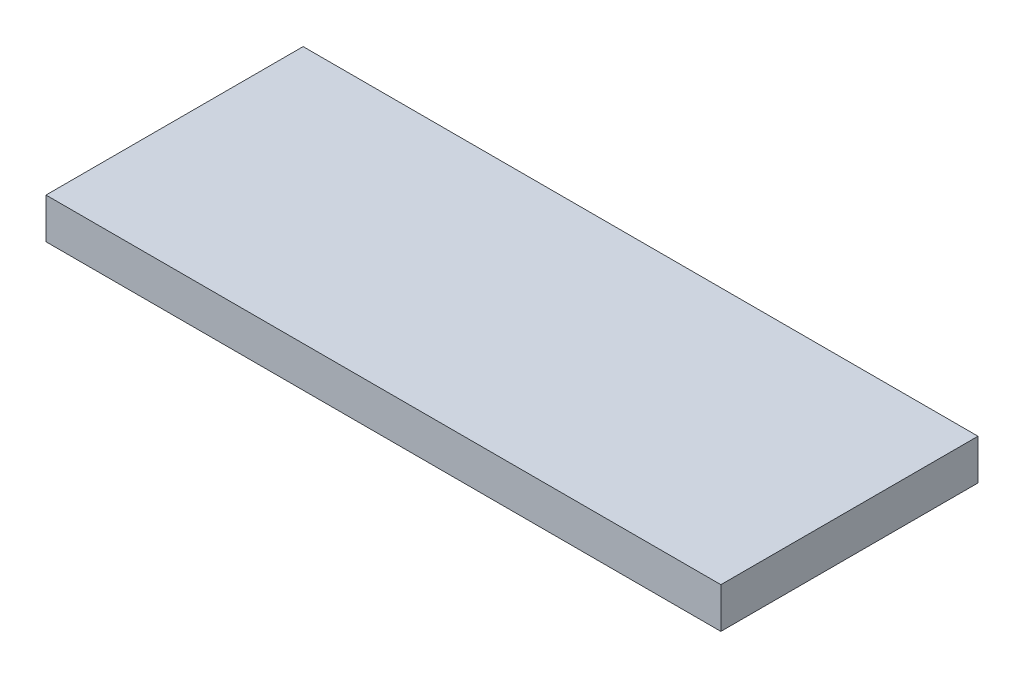
ISO-10303-21;
HEADER;
FILE_DESCRIPTION(('STEP AP214'),'2;1');
FILE_NAME('part.step','',(''),(''),'','','');
FILE_SCHEMA(('AUTOMOTIVE_DESIGN { 1 0 10303 214 1 1 1 1 }'));
ENDSEC;
DATA;
#1=APPLICATION_CONTEXT('core data for automotive mechanical design processes');
#2=APPLICATION_PROTOCOL_DEFINITION('international standard','automotive_design',2000,#1);
#3=PRODUCT_CONTEXT('',#1,'mechanical');
#4=PRODUCT('Part','Part','',(#3));
#5=PRODUCT_RELATED_PRODUCT_CATEGORY('part','',(#4));
#6=PRODUCT_DEFINITION_FORMATION('','',#4);
#7=PRODUCT_DEFINITION_CONTEXT('part definition',#1,'design');
#8=PRODUCT_DEFINITION('design','',#6,#7);
#9=PRODUCT_DEFINITION_SHAPE('','',#8);
#10=(LENGTH_UNIT() NAMED_UNIT(*) SI_UNIT(.MILLI.,.METRE.));
#11=(NAMED_UNIT(*) PLANE_ANGLE_UNIT() SI_UNIT($,.RADIAN.));
#12=(NAMED_UNIT(*) SI_UNIT($,.STERADIAN.) SOLID_ANGLE_UNIT());
#13=UNCERTAINTY_MEASURE_WITH_UNIT(LENGTH_MEASURE(1.E-05),#10,'distance_accuracy_value','');
#14=(GEOMETRIC_REPRESENTATION_CONTEXT(3) GLOBAL_UNCERTAINTY_ASSIGNED_CONTEXT((#13)) GLOBAL_UNIT_ASSIGNED_CONTEXT((#10,
#11,#12)) REPRESENTATION_CONTEXT('',''));
#15=CARTESIAN_POINT('',(0.,0.,0.));
#16=DIRECTION('',(0.,0.,1.));
#17=DIRECTION('',(1.,0.,0.));
#18=AXIS2_PLACEMENT_3D('',#15,#16,#17);
#19=CARTESIAN_POINT('',(25.,3.,9.525));
#20=DIRECTION('',(-1.,0.,0.));
#21=DIRECTION('',(0.,0.,1.));
#22=AXIS2_PLACEMENT_3D('',#19,#20,#21);
#23=PLANE('',#22);
#24=DIRECTION('',(0.,0.,-1.));
#25=VECTOR('',#24,1.);
#26=CARTESIAN_POINT('',(25.,0.,9.525));
#27=LINE('',#26,#25);
#28=CARTESIAN_POINT('',(25.,0.,9.525));
#29=VERTEX_POINT('',#28);
#30=CARTESIAN_POINT('',(25.,0.,-9.525));
#31=VERTEX_POINT('',#30);
#32=EDGE_CURVE('E98',#29,#31,#27,.T.);
#33=ORIENTED_EDGE('',*,*,#32,.T.);
#34=DIRECTION('',(0.,-1.,0.));
#35=VECTOR('',#34,1.);
#36=CARTESIAN_POINT('',(25.,3.,-9.525));
#37=LINE('',#36,#35);
#38=CARTESIAN_POINT('',(25.,3.,-9.525));
#39=VERTEX_POINT('',#38);
#40=EDGE_CURVE('E11',#39,#31,#37,.T.);
#41=ORIENTED_EDGE('',*,*,#40,.F.);
#42=DIRECTION('',(0.,0.,-1.));
#43=VECTOR('',#42,1.);
#44=CARTESIAN_POINT('',(25.,3.,9.525));
#45=LINE('',#44,#43);
#46=CARTESIAN_POINT('',(25.,3.,9.525));
#47=VERTEX_POINT('',#46);
#48=EDGE_CURVE('E86',#47,#39,#45,.T.);
#49=ORIENTED_EDGE('',*,*,#48,.F.);
#50=DIRECTION('',(0.,-1.,0.));
#51=VECTOR('',#50,1.);
#52=CARTESIAN_POINT('',(25.,3.,9.525));
#53=LINE('',#52,#51);
#54=EDGE_CURVE('E94',#47,#29,#53,.T.);
#55=ORIENTED_EDGE('',*,*,#54,.T.);
#56=EDGE_LOOP('',(#33,#41,#49,#55));
#57=FACE_BOUND('',#56,.T.);
#58=ADVANCED_FACE('F35',(#57),#23,.F.);
#59=CARTESIAN_POINT('',(-25.,3.,-9.525));
#60=DIRECTION('',(0.,0.,1.));
#61=DIRECTION('',(1.,0.,0.));
#62=AXIS2_PLACEMENT_3D('',#59,#60,#61);
#63=PLANE('',#62);
#64=DIRECTION('',(-1.,0.,0.));
#65=VECTOR('',#64,1.);
#66=CARTESIAN_POINT('',(-25.,0.,-9.525));
#67=LINE('',#66,#65);
#68=CARTESIAN_POINT('',(-25.,0.,-9.525));
#69=VERTEX_POINT('',#68);
#70=EDGE_CURVE('E90',#31,#69,#67,.T.);
#71=ORIENTED_EDGE('',*,*,#70,.T.);
#72=DIRECTION('',(0.,-1.,0.));
#73=VECTOR('',#72,1.);
#74=CARTESIAN_POINT('',(-25.,3.,-9.525));
#75=LINE('',#74,#73);
#76=CARTESIAN_POINT('',(-25.,3.,-9.525));
#77=VERTEX_POINT('',#76);
#78=EDGE_CURVE('E43',#77,#69,#75,.T.);
#79=ORIENTED_EDGE('',*,*,#78,.F.);
#80=DIRECTION('',(-1.,0.,0.));
#81=VECTOR('',#80,1.);
#82=CARTESIAN_POINT('',(-25.,3.,-9.525));
#83=LINE('',#82,#81);
#84=EDGE_CURVE('E81',#39,#77,#83,.T.);
#85=ORIENTED_EDGE('',*,*,#84,.F.);
#86=ORIENTED_EDGE('',*,*,#40,.T.);
#87=EDGE_LOOP('',(#71,#79,#85,#86));
#88=FACE_BOUND('',#87,.T.);
#89=ADVANCED_FACE('F89',(#88),#63,.F.);
#90=CARTESIAN_POINT('',(-25.,3.,9.525));
#91=DIRECTION('',(1.,0.,0.));
#92=DIRECTION('',(0.,0.,-1.));
#93=AXIS2_PLACEMENT_3D('',#90,#91,#92);
#94=PLANE('',#93);
#95=DIRECTION('',(0.,0.,1.));
#96=VECTOR('',#95,1.);
#97=CARTESIAN_POINT('',(-25.,0.,9.525));
#98=LINE('',#97,#96);
#99=CARTESIAN_POINT('',(-25.,0.,9.525));
#100=VERTEX_POINT('',#99);
#101=EDGE_CURVE('E68',#69,#100,#98,.T.);
#102=ORIENTED_EDGE('',*,*,#101,.T.);
#103=DIRECTION('',(0.,-1.,0.));
#104=VECTOR('',#103,1.);
#105=CARTESIAN_POINT('',(-25.,3.,9.525));
#106=LINE('',#105,#104);
#107=CARTESIAN_POINT('',(-25.,3.,9.525));
#108=VERTEX_POINT('',#107);
#109=EDGE_CURVE('E91',#108,#100,#106,.T.);
#110=ORIENTED_EDGE('',*,*,#109,.F.);
#111=DIRECTION('',(0.,0.,1.));
#112=VECTOR('',#111,1.);
#113=CARTESIAN_POINT('',(-25.,3.,9.525));
#114=LINE('',#113,#112);
#115=EDGE_CURVE('E84',#77,#108,#114,.T.);
#116=ORIENTED_EDGE('',*,*,#115,.F.);
#117=ORIENTED_EDGE('',*,*,#78,.T.);
#118=EDGE_LOOP('',(#102,#110,#116,#117));
#119=FACE_BOUND('',#118,.T.);
#120=ADVANCED_FACE('F92',(#119),#94,.F.);
#121=CARTESIAN_POINT('',(-25.,3.,9.525));
#122=DIRECTION('',(0.,0.,-1.));
#123=DIRECTION('',(-1.,0.,0.));
#124=AXIS2_PLACEMENT_3D('',#121,#122,#123);
#125=PLANE('',#124);
#126=DIRECTION('',(1.,0.,0.));
#127=VECTOR('',#126,1.);
#128=CARTESIAN_POINT('',(-25.,0.,9.525));
#129=LINE('',#128,#127);
#130=EDGE_CURVE('E74',#100,#29,#129,.T.);
#131=ORIENTED_EDGE('',*,*,#130,.T.);
#132=ORIENTED_EDGE('',*,*,#54,.F.);
#133=DIRECTION('',(1.,0.,0.));
#134=VECTOR('',#133,1.);
#135=CARTESIAN_POINT('',(-25.,3.,9.525));
#136=LINE('',#135,#134);
#137=EDGE_CURVE('E51',#108,#47,#136,.T.);
#138=ORIENTED_EDGE('',*,*,#137,.F.);
#139=ORIENTED_EDGE('',*,*,#109,.T.);
#140=EDGE_LOOP('',(#131,#132,#138,#139));
#141=FACE_BOUND('',#140,.T.);
#142=ADVANCED_FACE('F105',(#141),#125,.F.);
#143=CARTESIAN_POINT('',(0.,3.,0.));
#144=DIRECTION('',(0.,-1.,0.));
#145=DIRECTION('',(0.,0.,-1.));
#146=AXIS2_PLACEMENT_3D('',#143,#144,#145);
#147=PLANE('',#146);
#148=ORIENTED_EDGE('',*,*,#48,.T.);
#149=ORIENTED_EDGE('',*,*,#84,.T.);
#150=ORIENTED_EDGE('',*,*,#115,.T.);
#151=ORIENTED_EDGE('',*,*,#137,.T.);
#152=EDGE_LOOP('',(#148,#149,#150,#151));
#153=FACE_BOUND('',#152,.T.);
#154=ADVANCED_FACE('F82',(#153),#147,.F.);
#155=CARTESIAN_POINT('',(0.,0.,0.));
#156=DIRECTION('',(0.,-1.,0.));
#157=DIRECTION('',(0.,0.,-1.));
#158=AXIS2_PLACEMENT_3D('',#155,#156,#157);
#159=PLANE('',#158);
#160=ORIENTED_EDGE('',*,*,#32,.F.);
#161=ORIENTED_EDGE('',*,*,#130,.F.);
#162=ORIENTED_EDGE('',*,*,#101,.F.);
#163=ORIENTED_EDGE('',*,*,#70,.F.);
#164=EDGE_LOOP('',(#160,#161,#162,#163));
#165=FACE_BOUND('',#164,.T.);
#166=ADVANCED_FACE('F108',(#165),#159,.T.);
#167=CLOSED_SHELL('',(#58,#89,#120,#142,#154,#166));
#168=MANIFOLD_SOLID_BREP('B2',#167);
#169=ADVANCED_BREP_SHAPE_REPRESENTATION('',(#18,#168),#14);
#170=SHAPE_DEFINITION_REPRESENTATION(#9,#169);
ENDSEC;
END-ISO-10303-21;
